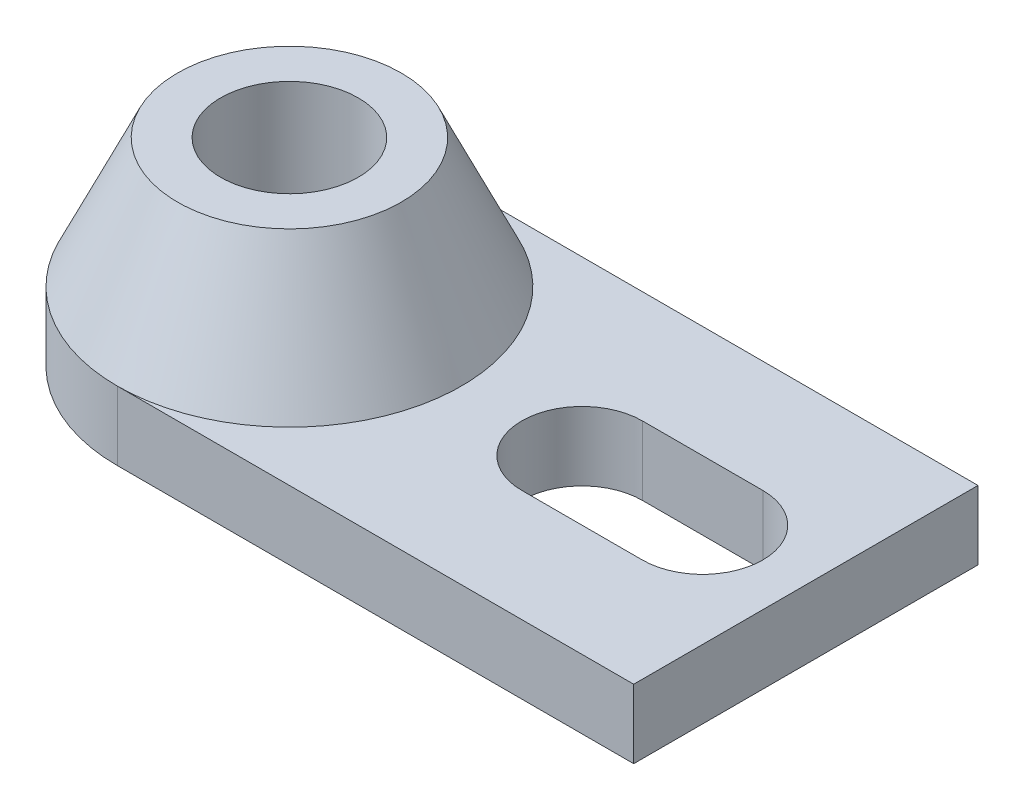
ISO-10303-21;
HEADER;
FILE_DESCRIPTION(('STEP AP214'),'2;1');
FILE_NAME('part.step','',(''),(''),'','','');
FILE_SCHEMA(('AUTOMOTIVE_DESIGN { 1 0 10303 214 1 1 1 1 }'));
ENDSEC;
DATA;
#1=APPLICATION_CONTEXT('core data for automotive mechanical design processes');
#2=APPLICATION_PROTOCOL_DEFINITION('international standard','automotive_design',2000,#1);
#3=PRODUCT_CONTEXT('',#1,'mechanical');
#4=PRODUCT('Part','Part','',(#3));
#5=PRODUCT_RELATED_PRODUCT_CATEGORY('part','',(#4));
#6=PRODUCT_DEFINITION_FORMATION('','',#4);
#7=PRODUCT_DEFINITION_CONTEXT('part definition',#1,'design');
#8=PRODUCT_DEFINITION('design','',#6,#7);
#9=PRODUCT_DEFINITION_SHAPE('','',#8);
#10=(LENGTH_UNIT() NAMED_UNIT(*) SI_UNIT(.MILLI.,.METRE.));
#11=(NAMED_UNIT(*) PLANE_ANGLE_UNIT() SI_UNIT($,.RADIAN.));
#12=(NAMED_UNIT(*) SI_UNIT($,.STERADIAN.) SOLID_ANGLE_UNIT());
#13=UNCERTAINTY_MEASURE_WITH_UNIT(LENGTH_MEASURE(1.E-05),#10,'distance_accuracy_value','');
#14=(GEOMETRIC_REPRESENTATION_CONTEXT(3) GLOBAL_UNCERTAINTY_ASSIGNED_CONTEXT((#13)) GLOBAL_UNIT_ASSIGNED_CONTEXT((#10,
#11,#12)) REPRESENTATION_CONTEXT('',''));
#15=CARTESIAN_POINT('',(0.,0.,0.));
#16=DIRECTION('',(0.,0.,1.));
#17=DIRECTION('',(1.,0.,0.));
#18=AXIS2_PLACEMENT_3D('',#15,#16,#17);
#19=CARTESIAN_POINT('',(-60.,8.,0.));
#20=DIRECTION('',(0.,-1.,0.));
#21=DIRECTION('',(0.,0.,-1.));
#22=AXIS2_PLACEMENT_3D('',#19,#20,#21);
#23=PLANE('',#22);
#24=DIRECTION('',(-1.,0.,0.));
#25=VECTOR('',#24,1.);
#26=CARTESIAN_POINT('',(0.,8.,-20.));
#27=LINE('',#26,#25);
#28=CARTESIAN_POINT('',(0.,8.,-20.));
#29=VERTEX_POINT('',#28);
#30=CARTESIAN_POINT('',(-60.,8.,-20.));
#31=VERTEX_POINT('',#30);
#32=EDGE_CURVE('E135',#29,#31,#27,.T.);
#33=ORIENTED_EDGE('',*,*,#32,.T.);
#34=CARTESIAN_POINT('',(-60.,8.,0.));
#35=DIRECTION('',(0.,-1.,0.));
#36=DIRECTION('',(0.,0.,-1.));
#37=AXIS2_PLACEMENT_3D('',#34,#35,#36);
#38=CIRCLE('',#37,20.);
#39=CARTESIAN_POINT('',(-60.,8.,20.));
#40=VERTEX_POINT('',#39);
#41=EDGE_CURVE('E133',#31,#40,#38,.T.);
#42=ORIENTED_EDGE('',*,*,#41,.T.);
#43=DIRECTION('',(1.,0.,0.));
#44=VECTOR('',#43,1.);
#45=CARTESIAN_POINT('',(0.,8.,20.));
#46=LINE('',#45,#44);
#47=CARTESIAN_POINT('',(0.,8.,20.));
#48=VERTEX_POINT('',#47);
#49=EDGE_CURVE('E108',#40,#48,#46,.T.);
#50=ORIENTED_EDGE('',*,*,#49,.T.);
#51=DIRECTION('',(0.,0.,-1.));
#52=VECTOR('',#51,1.);
#53=CARTESIAN_POINT('',(0.,8.,20.));
#54=LINE('',#53,#52);
#55=EDGE_CURVE('E146',#48,#29,#54,.T.);
#56=ORIENTED_EDGE('',*,*,#55,.T.);
#57=EDGE_LOOP('',(#33,#42,#50,#56));
#58=FACE_BOUND('',#57,.T.);
#59=CARTESIAN_POINT('',(-12.,8.,0.));
#60=DIRECTION('',(0.,1.,0.));
#61=DIRECTION('',(0.,0.,1.));
#62=AXIS2_PLACEMENT_3D('',#59,#60,#61);
#63=CIRCLE('',#62,7.);
#64=CARTESIAN_POINT('',(-12.,8.,7.));
#65=VERTEX_POINT('',#64);
#66=CARTESIAN_POINT('',(-12.,8.,-7.));
#67=VERTEX_POINT('',#66);
#68=EDGE_CURVE('E184',#65,#67,#63,.T.);
#69=ORIENTED_EDGE('',*,*,#68,.F.);
#70=DIRECTION('',(1.,0.,0.));
#71=VECTOR('',#70,1.);
#72=CARTESIAN_POINT('',(-26.,8.,7.));
#73=LINE('',#72,#71);
#74=CARTESIAN_POINT('',(-26.,8.,7.));
#75=VERTEX_POINT('',#74);
#76=EDGE_CURVE('E197',#75,#65,#73,.T.);
#77=ORIENTED_EDGE('',*,*,#76,.F.);
#78=CARTESIAN_POINT('',(-26.,8.,0.));
#79=DIRECTION('',(0.,1.,0.));
#80=DIRECTION('',(0.,0.,-1.));
#81=AXIS2_PLACEMENT_3D('',#78,#79,#80);
#82=CIRCLE('',#81,7.);
#83=CARTESIAN_POINT('',(-26.,8.,-7.));
#84=VERTEX_POINT('',#83);
#85=EDGE_CURVE('E207',#84,#75,#82,.T.);
#86=ORIENTED_EDGE('',*,*,#85,.F.);
#87=DIRECTION('',(-1.,0.,0.));
#88=VECTOR('',#87,1.);
#89=CARTESIAN_POINT('',(-26.,8.,-7.));
#90=LINE('',#89,#88);
#91=EDGE_CURVE('E188',#67,#84,#90,.T.);
#92=ORIENTED_EDGE('',*,*,#91,.F.);
#93=EDGE_LOOP('',(#69,#77,#86,#92));
#94=FACE_BOUND('',#93,.T.);
#95=ADVANCED_FACE('F39',(#58,#94),#23,.F.);
#96=CARTESIAN_POINT('',(-60.,0.,0.));
#97=DIRECTION('',(0.,-1.,0.));
#98=DIRECTION('',(0.,0.,-1.));
#99=AXIS2_PLACEMENT_3D('',#96,#97,#98);
#100=PLANE('',#99);
#101=DIRECTION('',(0.,0.,-1.));
#102=VECTOR('',#101,1.);
#103=CARTESIAN_POINT('',(0.,0.,20.));
#104=LINE('',#103,#102);
#105=CARTESIAN_POINT('',(0.,0.,20.));
#106=VERTEX_POINT('',#105);
#107=CARTESIAN_POINT('',(0.,0.,-20.));
#108=VERTEX_POINT('',#107);
#109=EDGE_CURVE('E150',#106,#108,#104,.T.);
#110=ORIENTED_EDGE('',*,*,#109,.F.);
#111=DIRECTION('',(1.,0.,0.));
#112=VECTOR('',#111,1.);
#113=CARTESIAN_POINT('',(0.,0.,20.));
#114=LINE('',#113,#112);
#115=CARTESIAN_POINT('',(-60.,0.,20.));
#116=VERTEX_POINT('',#115);
#117=EDGE_CURVE('E160',#116,#106,#114,.T.);
#118=ORIENTED_EDGE('',*,*,#117,.F.);
#119=CARTESIAN_POINT('',(-60.,0.,0.));
#120=DIRECTION('',(0.,1.,0.));
#121=DIRECTION('',(0.,0.,-1.));
#122=AXIS2_PLACEMENT_3D('',#119,#120,#121);
#123=CIRCLE('',#122,20.);
#124=CARTESIAN_POINT('',(-60.,0.,-20.));
#125=VERTEX_POINT('',#124);
#126=EDGE_CURVE('E129',#125,#116,#123,.T.);
#127=ORIENTED_EDGE('',*,*,#126,.F.);
#128=DIRECTION('',(-1.,0.,0.));
#129=VECTOR('',#128,1.);
#130=CARTESIAN_POINT('',(0.,0.,-20.));
#131=LINE('',#130,#129);
#132=EDGE_CURVE('E154',#108,#125,#131,.T.);
#133=ORIENTED_EDGE('',*,*,#132,.F.);
#134=EDGE_LOOP('',(#110,#118,#127,#133));
#135=FACE_BOUND('',#134,.T.);
#136=DIRECTION('',(1.,0.,0.));
#137=VECTOR('',#136,1.);
#138=CARTESIAN_POINT('',(-26.,0.,7.));
#139=LINE('',#138,#137);
#140=CARTESIAN_POINT('',(-26.,0.,7.));
#141=VERTEX_POINT('',#140);
#142=CARTESIAN_POINT('',(-12.,0.,7.));
#143=VERTEX_POINT('',#142);
#144=EDGE_CURVE('E179',#141,#143,#139,.T.);
#145=ORIENTED_EDGE('',*,*,#144,.T.);
#146=CARTESIAN_POINT('',(-12.,0.,0.));
#147=DIRECTION('',(0.,1.,0.));
#148=DIRECTION('',(0.,0.,1.));
#149=AXIS2_PLACEMENT_3D('',#146,#147,#148);
#150=CIRCLE('',#149,7.);
#151=CARTESIAN_POINT('',(-12.,0.,-7.));
#152=VERTEX_POINT('',#151);
#153=EDGE_CURVE('E64',#143,#152,#150,.T.);
#154=ORIENTED_EDGE('',*,*,#153,.T.);
#155=DIRECTION('',(-1.,0.,0.));
#156=VECTOR('',#155,1.);
#157=CARTESIAN_POINT('',(-26.,0.,-7.));
#158=LINE('',#157,#156);
#159=CARTESIAN_POINT('',(-26.,0.,-7.));
#160=VERTEX_POINT('',#159);
#161=EDGE_CURVE('E190',#152,#160,#158,.T.);
#162=ORIENTED_EDGE('',*,*,#161,.T.);
#163=CARTESIAN_POINT('',(-26.,0.,0.));
#164=DIRECTION('',(0.,1.,0.));
#165=DIRECTION('',(0.,0.,-1.));
#166=AXIS2_PLACEMENT_3D('',#163,#164,#165);
#167=CIRCLE('',#166,7.);
#168=EDGE_CURVE('E182',#160,#141,#167,.T.);
#169=ORIENTED_EDGE('',*,*,#168,.T.);
#170=EDGE_LOOP('',(#145,#154,#162,#169));
#171=FACE_BOUND('',#170,.T.);
#172=ADVANCED_FACE('F173',(#135,#171),#100,.T.);
#173=CARTESIAN_POINT('',(0.,8.,20.));
#174=DIRECTION('',(-1.,0.,0.));
#175=DIRECTION('',(0.,0.,1.));
#176=AXIS2_PLACEMENT_3D('',#173,#174,#175);
#177=PLANE('',#176);
#178=ORIENTED_EDGE('',*,*,#109,.T.);
#179=DIRECTION('',(0.,-1.,0.));
#180=VECTOR('',#179,1.);
#181=CARTESIAN_POINT('',(0.,8.,-20.));
#182=LINE('',#181,#180);
#183=EDGE_CURVE('E43',#29,#108,#182,.T.);
#184=ORIENTED_EDGE('',*,*,#183,.F.);
#185=ORIENTED_EDGE('',*,*,#55,.F.);
#186=DIRECTION('',(0.,-1.,0.));
#187=VECTOR('',#186,1.);
#188=CARTESIAN_POINT('',(0.,8.,20.));
#189=LINE('',#188,#187);
#190=EDGE_CURVE('E114',#48,#106,#189,.T.);
#191=ORIENTED_EDGE('',*,*,#190,.T.);
#192=EDGE_LOOP('',(#178,#184,#185,#191));
#193=FACE_BOUND('',#192,.T.);
#194=ADVANCED_FACE('F41',(#193),#177,.F.);
#195=CARTESIAN_POINT('',(0.,8.,-20.));
#196=DIRECTION('',(0.,0.,1.));
#197=DIRECTION('',(1.,0.,0.));
#198=AXIS2_PLACEMENT_3D('',#195,#196,#197);
#199=PLANE('',#198);
#200=ORIENTED_EDGE('',*,*,#132,.T.);
#201=DIRECTION('',(0.,-1.,0.));
#202=VECTOR('',#201,1.);
#203=CARTESIAN_POINT('',(-60.,8.,-20.));
#204=LINE('',#203,#202);
#205=EDGE_CURVE('E131',#31,#125,#204,.T.);
#206=ORIENTED_EDGE('',*,*,#205,.F.);
#207=ORIENTED_EDGE('',*,*,#32,.F.);
#208=ORIENTED_EDGE('',*,*,#183,.T.);
#209=EDGE_LOOP('',(#200,#206,#207,#208));
#210=FACE_BOUND('',#209,.T.);
#211=ADVANCED_FACE('F169',(#210),#199,.F.);
#212=CARTESIAN_POINT('',(-60.,8.,0.));
#213=DIRECTION('',(0.,-1.,0.));
#214=DIRECTION('',(0.,0.,-1.));
#215=AXIS2_PLACEMENT_3D('',#212,#213,#214);
#216=CYLINDRICAL_SURFACE('',#215,20.);
#217=ORIENTED_EDGE('',*,*,#126,.T.);
#218=DIRECTION('',(0.,-1.,0.));
#219=VECTOR('',#218,1.);
#220=CARTESIAN_POINT('',(-60.,8.,20.));
#221=LINE('',#220,#219);
#222=EDGE_CURVE('E111',#40,#116,#221,.T.);
#223=ORIENTED_EDGE('',*,*,#222,.F.);
#224=CARTESIAN_POINT('',(-60.,8.,0.));
#225=DIRECTION('',(0.,1.,0.));
#226=DIRECTION('',(0.,0.,-1.));
#227=AXIS2_PLACEMENT_3D('',#224,#225,#226);
#228=CIRCLE('',#227,20.);
#229=EDGE_CURVE('E120',#31,#40,#228,.T.);
#230=ORIENTED_EDGE('',*,*,#229,.F.);
#231=ORIENTED_EDGE('',*,*,#205,.T.);
#232=EDGE_LOOP('',(#217,#223,#230,#231));
#233=FACE_BOUND('',#232,.T.);
#234=ADVANCED_FACE('F124',(#233),#216,.T.);
#235=CARTESIAN_POINT('',(0.,8.,20.));
#236=DIRECTION('',(0.,0.,-1.));
#237=DIRECTION('',(-1.,0.,0.));
#238=AXIS2_PLACEMENT_3D('',#235,#236,#237);
#239=PLANE('',#238);
#240=ORIENTED_EDGE('',*,*,#117,.T.);
#241=ORIENTED_EDGE('',*,*,#190,.F.);
#242=ORIENTED_EDGE('',*,*,#49,.F.);
#243=ORIENTED_EDGE('',*,*,#222,.T.);
#244=EDGE_LOOP('',(#240,#241,#242,#243));
#245=FACE_BOUND('',#244,.T.);
#246=ADVANCED_FACE('F110',(#245),#239,.F.);
#247=CARTESIAN_POINT('',(-12.,8.,0.));
#248=DIRECTION('',(0.,-1.,0.));
#249=DIRECTION('',(0.,0.,-1.));
#250=AXIS2_PLACEMENT_3D('',#247,#248,#249);
#251=CYLINDRICAL_SURFACE('',#250,7.);
#252=ORIENTED_EDGE('',*,*,#153,.F.);
#253=DIRECTION('',(0.,-1.,0.));
#254=VECTOR('',#253,1.);
#255=CARTESIAN_POINT('',(-12.,8.,7.));
#256=LINE('',#255,#254);
#257=EDGE_CURVE('E194',#65,#143,#256,.T.);
#258=ORIENTED_EDGE('',*,*,#257,.F.);
#259=ORIENTED_EDGE('',*,*,#68,.T.);
#260=DIRECTION('',(0.,-1.,0.));
#261=VECTOR('',#260,1.);
#262=CARTESIAN_POINT('',(-12.,8.,-7.));
#263=LINE('',#262,#261);
#264=EDGE_CURVE('E155',#67,#152,#263,.T.);
#265=ORIENTED_EDGE('',*,*,#264,.T.);
#266=EDGE_LOOP('',(#252,#258,#259,#265));
#267=FACE_BOUND('',#266,.T.);
#268=ADVANCED_FACE('F221',(#267),#251,.F.);
#269=CARTESIAN_POINT('',(-26.,8.,-7.));
#270=DIRECTION('',(0.,0.,1.));
#271=DIRECTION('',(1.,0.,0.));
#272=AXIS2_PLACEMENT_3D('',#269,#270,#271);
#273=PLANE('',#272);
#274=ORIENTED_EDGE('',*,*,#161,.F.);
#275=ORIENTED_EDGE('',*,*,#264,.F.);
#276=ORIENTED_EDGE('',*,*,#91,.T.);
#277=DIRECTION('',(0.,-1.,0.));
#278=VECTOR('',#277,1.);
#279=CARTESIAN_POINT('',(-26.,8.,-7.));
#280=LINE('',#279,#278);
#281=EDGE_CURVE('E200',#84,#160,#280,.T.);
#282=ORIENTED_EDGE('',*,*,#281,.T.);
#283=EDGE_LOOP('',(#274,#275,#276,#282));
#284=FACE_BOUND('',#283,.T.);
#285=ADVANCED_FACE('F220',(#284),#273,.T.);
#286=CARTESIAN_POINT('',(-26.,8.,0.));
#287=DIRECTION('',(0.,-1.,0.));
#288=DIRECTION('',(0.,0.,-1.));
#289=AXIS2_PLACEMENT_3D('',#286,#287,#288);
#290=CYLINDRICAL_SURFACE('',#289,7.);
#291=ORIENTED_EDGE('',*,*,#168,.F.);
#292=ORIENTED_EDGE('',*,*,#281,.F.);
#293=ORIENTED_EDGE('',*,*,#85,.T.);
#294=DIRECTION('',(0.,-1.,0.));
#295=VECTOR('',#294,1.);
#296=CARTESIAN_POINT('',(-26.,8.,7.));
#297=LINE('',#296,#295);
#298=EDGE_CURVE('E56',#75,#141,#297,.T.);
#299=ORIENTED_EDGE('',*,*,#298,.T.);
#300=EDGE_LOOP('',(#291,#292,#293,#299));
#301=FACE_BOUND('',#300,.T.);
#302=ADVANCED_FACE('F226',(#301),#290,.F.);
#303=CARTESIAN_POINT('',(-26.,8.,7.));
#304=DIRECTION('',(0.,0.,-1.));
#305=DIRECTION('',(-1.,0.,0.));
#306=AXIS2_PLACEMENT_3D('',#303,#304,#305);
#307=PLANE('',#306);
#308=ORIENTED_EDGE('',*,*,#144,.F.);
#309=ORIENTED_EDGE('',*,*,#298,.F.);
#310=ORIENTED_EDGE('',*,*,#76,.T.);
#311=ORIENTED_EDGE('',*,*,#257,.T.);
#312=EDGE_LOOP('',(#308,#309,#310,#311));
#313=FACE_BOUND('',#312,.T.);
#314=ADVANCED_FACE('F228',(#313),#307,.T.);
#315=CARTESIAN_POINT('',(-60.,8.,0.));
#316=DIRECTION('',(0.,-1.,0.));
#317=DIRECTION('',(0.,0.,-1.));
#318=AXIS2_PLACEMENT_3D('',#315,#316,#317);
#319=CYLINDRICAL_SURFACE('',#318,8.00000000000001);
#320=CARTESIAN_POINT('',(-60.,23.,0.));
#321=DIRECTION('',(0.,-1.,0.));
#322=DIRECTION('',(0.,0.,-1.));
#323=AXIS2_PLACEMENT_3D('',#320,#321,#322);
#324=CIRCLE('',#323,8.00000000000001);
#325=CARTESIAN_POINT('',(-60.,23.,-8.00000000000001));
#326=VERTEX_POINT('',#325);
#327=EDGE_CURVE('E218',#326,#326,#324,.T.);
#328=ORIENTED_EDGE('',*,*,#327,.F.);
#329=EDGE_LOOP('',(#328));
#330=FACE_BOUND('',#329,.T.);
#331=CARTESIAN_POINT('',(-60.,8.,0.));
#332=DIRECTION('',(0.,-1.,0.));
#333=DIRECTION('',(0.,0.,-1.));
#334=AXIS2_PLACEMENT_3D('',#331,#332,#333);
#335=CIRCLE('',#334,8.00000000000001);
#336=CARTESIAN_POINT('',(-60.,8.,-8.00000000000001));
#337=VERTEX_POINT('',#336);
#338=EDGE_CURVE('E11',#337,#337,#335,.T.);
#339=ORIENTED_EDGE('',*,*,#338,.T.);
#340=EDGE_LOOP('',(#339));
#341=FACE_BOUND('',#340,.T.);
#342=ADVANCED_FACE('F234',(#330,#341),#319,.F.);
#343=CARTESIAN_POINT('',(-68.,23.,0.));
#344=DIRECTION('',(0.,-1.,0.));
#345=DIRECTION('',(0.,0.,-1.));
#346=AXIS2_PLACEMENT_3D('',#343,#344,#345);
#347=PLANE('',#346);
#348=CARTESIAN_POINT('',(-60.,23.,0.));
#349=DIRECTION('',(0.,-1.,0.));
#350=DIRECTION('',(0.,0.,-1.));
#351=AXIS2_PLACEMENT_3D('',#348,#349,#350);
#352=CIRCLE('',#351,13.);
#353=CARTESIAN_POINT('',(-60.,23.,-13.));
#354=VERTEX_POINT('',#353);
#355=EDGE_CURVE('E139',#354,#354,#352,.T.);
#356=ORIENTED_EDGE('',*,*,#355,.F.);
#357=EDGE_LOOP('',(#356));
#358=FACE_BOUND('',#357,.T.);
#359=ORIENTED_EDGE('',*,*,#327,.T.);
#360=EDGE_LOOP('',(#359));
#361=FACE_BOUND('',#360,.T.);
#362=ADVANCED_FACE('F248',(#358,#361),#347,.F.);
#363=CARTESIAN_POINT('',(-60.,23.,0.));
#364=DIRECTION('',(0.,-1.,0.));
#365=DIRECTION('',(0.,0.,-1.));
#366=AXIS2_PLACEMENT_3D('',#363,#364,#365);
#367=CONICAL_SURFACE('',#366,13.,0.43662715981354);
#368=ORIENTED_EDGE('',*,*,#41,.F.);
#369=ORIENTED_EDGE('',*,*,#229,.T.);
#370=EDGE_LOOP('',(#368,#369));
#371=FACE_BOUND('',#370,.T.);
#372=ORIENTED_EDGE('',*,*,#355,.T.);
#373=EDGE_LOOP('',(#372));
#374=FACE_BOUND('',#373,.T.);
#375=ADVANCED_FACE('F141',(#371,#374),#367,.T.);
#376=ORIENTED_EDGE('',*,*,#338,.F.);
#377=EDGE_LOOP('',(#376));
#378=FACE_BOUND('',#377,.T.);
#379=ADVANCED_FACE('F239',(#378),#23,.F.);
#380=CLOSED_SHELL('',(#95,#172,#194,#211,#234,#246,#268,#285,#302,#314,#342,#362,#375,#379));
#381=MANIFOLD_SOLID_BREP('B2',#380);
#382=ADVANCED_BREP_SHAPE_REPRESENTATION('',(#18,#381),#14);
#383=SHAPE_DEFINITION_REPRESENTATION(#9,#382);
ENDSEC;
END-ISO-10303-21;
